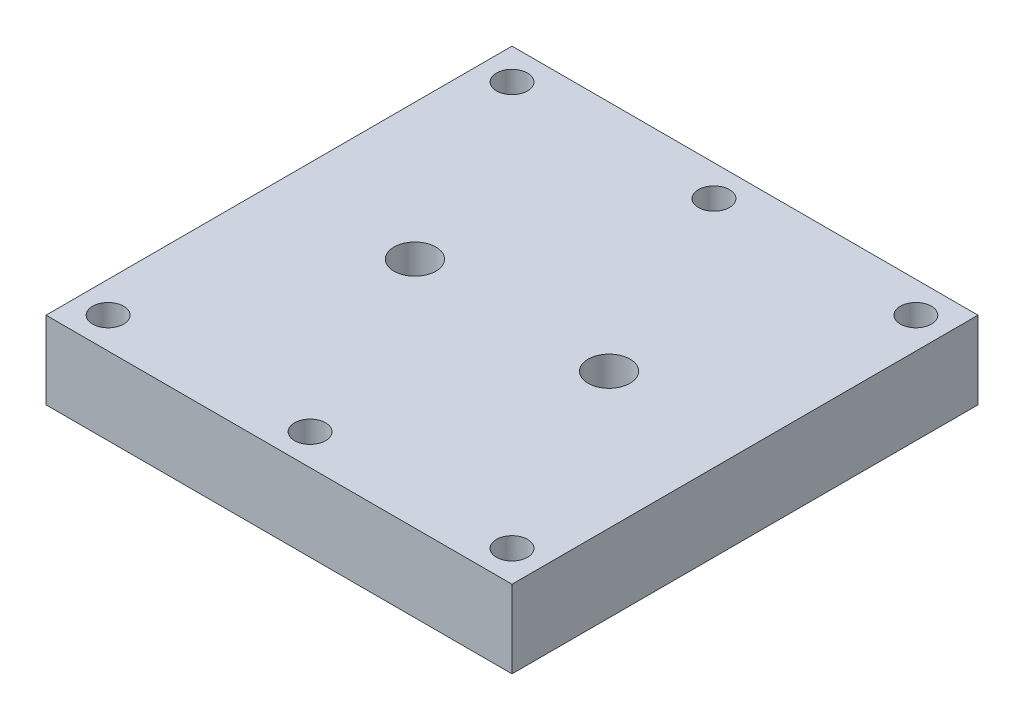
ISO-10303-21;
HEADER;
FILE_DESCRIPTION(('STEP AP214'),'2;1');
FILE_NAME('part.step','',(''),(''),'','','');
FILE_SCHEMA(('AUTOMOTIVE_DESIGN { 1 0 10303 214 1 1 1 1 }'));
ENDSEC;
DATA;
#1=APPLICATION_CONTEXT('core data for automotive mechanical design processes');
#2=APPLICATION_PROTOCOL_DEFINITION('international standard','automotive_design',2000,#1);
#3=PRODUCT_CONTEXT('',#1,'mechanical');
#4=PRODUCT('Part','Part','',(#3));
#5=PRODUCT_RELATED_PRODUCT_CATEGORY('part','',(#4));
#6=PRODUCT_DEFINITION_FORMATION('','',#4);
#7=PRODUCT_DEFINITION_CONTEXT('part definition',#1,'design');
#8=PRODUCT_DEFINITION('design','',#6,#7);
#9=PRODUCT_DEFINITION_SHAPE('','',#8);
#10=(LENGTH_UNIT() NAMED_UNIT(*) SI_UNIT(.MILLI.,.METRE.));
#11=(NAMED_UNIT(*) PLANE_ANGLE_UNIT() SI_UNIT($,.RADIAN.));
#12=(NAMED_UNIT(*) SI_UNIT($,.STERADIAN.) SOLID_ANGLE_UNIT());
#13=UNCERTAINTY_MEASURE_WITH_UNIT(LENGTH_MEASURE(1.E-05),#10,'distance_accuracy_value','');
#14=(GEOMETRIC_REPRESENTATION_CONTEXT(3) GLOBAL_UNCERTAINTY_ASSIGNED_CONTEXT((#13)) GLOBAL_UNIT_ASSIGNED_CONTEXT((#10,
#11,#12)) REPRESENTATION_CONTEXT('',''));
#15=CARTESIAN_POINT('',(0.,0.,0.));
#16=DIRECTION('',(0.,0.,1.));
#17=DIRECTION('',(1.,0.,0.));
#18=AXIS2_PLACEMENT_3D('',#15,#16,#17);
#19=CARTESIAN_POINT('',(-30.,10.,30.));
#20=DIRECTION('',(1.,0.,0.));
#21=DIRECTION('',(0.,0.,-1.));
#22=AXIS2_PLACEMENT_3D('',#19,#20,#21);
#23=PLANE('',#22);
#24=DIRECTION('',(0.,0.,1.));
#25=VECTOR('',#24,1.);
#26=CARTESIAN_POINT('',(-30.,0.,30.));
#27=LINE('',#26,#25);
#28=CARTESIAN_POINT('',(-30.,0.,-30.));
#29=VERTEX_POINT('',#28);
#30=CARTESIAN_POINT('',(-30.,0.,30.));
#31=VERTEX_POINT('',#30);
#32=EDGE_CURVE('E100',#29,#31,#27,.T.);
#33=ORIENTED_EDGE('',*,*,#32,.T.);
#34=DIRECTION('',(0.,-1.,0.));
#35=VECTOR('',#34,1.);
#36=CARTESIAN_POINT('',(-30.,10.,30.));
#37=LINE('',#36,#35);
#38=CARTESIAN_POINT('',(-30.,10.,30.));
#39=VERTEX_POINT('',#38);
#40=EDGE_CURVE('E11',#39,#31,#37,.T.);
#41=ORIENTED_EDGE('',*,*,#40,.F.);
#42=DIRECTION('',(0.,0.,1.));
#43=VECTOR('',#42,1.);
#44=CARTESIAN_POINT('',(-30.,10.,30.));
#45=LINE('',#44,#43);
#46=CARTESIAN_POINT('',(-30.,10.,-30.));
#47=VERTEX_POINT('',#46);
#48=EDGE_CURVE('E88',#47,#39,#45,.T.);
#49=ORIENTED_EDGE('',*,*,#48,.F.);
#50=DIRECTION('',(0.,-1.,0.));
#51=VECTOR('',#50,1.);
#52=CARTESIAN_POINT('',(-30.,10.,-30.));
#53=LINE('',#52,#51);
#54=EDGE_CURVE('E96',#47,#29,#53,.T.);
#55=ORIENTED_EDGE('',*,*,#54,.T.);
#56=EDGE_LOOP('',(#33,#41,#49,#55));
#57=FACE_BOUND('',#56,.T.);
#58=ADVANCED_FACE('F37',(#57),#23,.F.);
#59=CARTESIAN_POINT('',(30.,10.,30.));
#60=DIRECTION('',(0.,0.,-1.));
#61=DIRECTION('',(-1.,0.,0.));
#62=AXIS2_PLACEMENT_3D('',#59,#60,#61);
#63=PLANE('',#62);
#64=DIRECTION('',(1.,0.,0.));
#65=VECTOR('',#64,1.);
#66=CARTESIAN_POINT('',(30.,0.,30.));
#67=LINE('',#66,#65);
#68=CARTESIAN_POINT('',(30.,0.,30.));
#69=VERTEX_POINT('',#68);
#70=EDGE_CURVE('E92',#31,#69,#67,.T.);
#71=ORIENTED_EDGE('',*,*,#70,.T.);
#72=DIRECTION('',(0.,-1.,0.));
#73=VECTOR('',#72,1.);
#74=CARTESIAN_POINT('',(30.,10.,30.));
#75=LINE('',#74,#73);
#76=CARTESIAN_POINT('',(30.,10.,30.));
#77=VERTEX_POINT('',#76);
#78=EDGE_CURVE('E45',#77,#69,#75,.T.);
#79=ORIENTED_EDGE('',*,*,#78,.F.);
#80=DIRECTION('',(1.,0.,0.));
#81=VECTOR('',#80,1.);
#82=CARTESIAN_POINT('',(30.,10.,30.));
#83=LINE('',#82,#81);
#84=EDGE_CURVE('E83',#39,#77,#83,.T.);
#85=ORIENTED_EDGE('',*,*,#84,.F.);
#86=ORIENTED_EDGE('',*,*,#40,.T.);
#87=EDGE_LOOP('',(#71,#79,#85,#86));
#88=FACE_BOUND('',#87,.T.);
#89=ADVANCED_FACE('F91',(#88),#63,.F.);
#90=CARTESIAN_POINT('',(30.,10.,30.));
#91=DIRECTION('',(-1.,0.,0.));
#92=DIRECTION('',(0.,0.,1.));
#93=AXIS2_PLACEMENT_3D('',#90,#91,#92);
#94=PLANE('',#93);
#95=DIRECTION('',(0.,0.,-1.));
#96=VECTOR('',#95,1.);
#97=CARTESIAN_POINT('',(30.,0.,30.));
#98=LINE('',#97,#96);
#99=CARTESIAN_POINT('',(30.,0.,-30.));
#100=VERTEX_POINT('',#99);
#101=EDGE_CURVE('E70',#69,#100,#98,.T.);
#102=ORIENTED_EDGE('',*,*,#101,.T.);
#103=DIRECTION('',(0.,-1.,0.));
#104=VECTOR('',#103,1.);
#105=CARTESIAN_POINT('',(30.,10.,-30.));
#106=LINE('',#105,#104);
#107=CARTESIAN_POINT('',(30.,10.,-30.));
#108=VERTEX_POINT('',#107);
#109=EDGE_CURVE('E93',#108,#100,#106,.T.);
#110=ORIENTED_EDGE('',*,*,#109,.F.);
#111=DIRECTION('',(0.,0.,-1.));
#112=VECTOR('',#111,1.);
#113=CARTESIAN_POINT('',(30.,10.,30.));
#114=LINE('',#113,#112);
#115=EDGE_CURVE('E86',#77,#108,#114,.T.);
#116=ORIENTED_EDGE('',*,*,#115,.F.);
#117=ORIENTED_EDGE('',*,*,#78,.T.);
#118=EDGE_LOOP('',(#102,#110,#116,#117));
#119=FACE_BOUND('',#118,.T.);
#120=ADVANCED_FACE('F94',(#119),#94,.F.);
#121=CARTESIAN_POINT('',(30.,10.,-30.));
#122=DIRECTION('',(0.,0.,1.));
#123=DIRECTION('',(1.,0.,0.));
#124=AXIS2_PLACEMENT_3D('',#121,#122,#123);
#125=PLANE('',#124);
#126=DIRECTION('',(-1.,0.,0.));
#127=VECTOR('',#126,1.);
#128=CARTESIAN_POINT('',(30.,0.,-30.));
#129=LINE('',#128,#127);
#130=EDGE_CURVE('E76',#100,#29,#129,.T.);
#131=ORIENTED_EDGE('',*,*,#130,.T.);
#132=ORIENTED_EDGE('',*,*,#54,.F.);
#133=DIRECTION('',(-1.,0.,0.));
#134=VECTOR('',#133,1.);
#135=CARTESIAN_POINT('',(30.,10.,-30.));
#136=LINE('',#135,#134);
#137=EDGE_CURVE('E53',#108,#47,#136,.T.);
#138=ORIENTED_EDGE('',*,*,#137,.F.);
#139=ORIENTED_EDGE('',*,*,#109,.T.);
#140=EDGE_LOOP('',(#131,#132,#138,#139));
#141=FACE_BOUND('',#140,.T.);
#142=ADVANCED_FACE('F108',(#141),#125,.F.);
#143=CARTESIAN_POINT('',(0.,10.,0.));
#144=DIRECTION('',(0.,1.,0.));
#145=DIRECTION('',(0.,0.,1.));
#146=AXIS2_PLACEMENT_3D('',#143,#144,#145);
#147=PLANE('',#146);
#148=CARTESIAN_POINT('',(-12.5,10.,0.));
#149=DIRECTION('',(0.,1.,0.));
#150=DIRECTION('',(0.,0.,1.));
#151=AXIS2_PLACEMENT_3D('',#148,#149,#150);
#152=CIRCLE('',#151,2.7);
#153=CARTESIAN_POINT('',(-12.5,10.,2.7));
#154=VERTEX_POINT('',#153);
#155=EDGE_CURVE('E162',#154,#154,#152,.T.);
#156=ORIENTED_EDGE('',*,*,#155,.F.);
#157=EDGE_LOOP('',(#156));
#158=FACE_BOUND('',#157,.T.);
#159=CARTESIAN_POINT('',(12.5,10.,0.));
#160=DIRECTION('',(0.,1.,0.));
#161=DIRECTION('',(0.,0.,1.));
#162=AXIS2_PLACEMENT_3D('',#159,#160,#161);
#163=CIRCLE('',#162,2.7);
#164=CARTESIAN_POINT('',(12.5,10.,2.7));
#165=VERTEX_POINT('',#164);
#166=EDGE_CURVE('E156',#165,#165,#163,.T.);
#167=ORIENTED_EDGE('',*,*,#166,.F.);
#168=EDGE_LOOP('',(#167));
#169=FACE_BOUND('',#168,.T.);
#170=CARTESIAN_POINT('',(0.,10.,-26.));
#171=DIRECTION('',(0.,1.,0.));
#172=DIRECTION('',(0.,0.,1.));
#173=AXIS2_PLACEMENT_3D('',#170,#171,#172);
#174=CIRCLE('',#173,2.);
#175=CARTESIAN_POINT('',(0.,10.,-24.));
#176=VERTEX_POINT('',#175);
#177=EDGE_CURVE('E144',#176,#176,#174,.T.);
#178=ORIENTED_EDGE('',*,*,#177,.F.);
#179=EDGE_LOOP('',(#178));
#180=FACE_BOUND('',#179,.T.);
#181=CARTESIAN_POINT('',(26.,10.,-26.));
#182=DIRECTION('',(0.,1.,0.));
#183=DIRECTION('',(0.,0.,1.));
#184=AXIS2_PLACEMENT_3D('',#181,#182,#183);
#185=CIRCLE('',#184,2.);
#186=CARTESIAN_POINT('',(26.,10.,-24.));
#187=VERTEX_POINT('',#186);
#188=EDGE_CURVE('E138',#187,#187,#185,.T.);
#189=ORIENTED_EDGE('',*,*,#188,.F.);
#190=EDGE_LOOP('',(#189));
#191=FACE_BOUND('',#190,.T.);
#192=CARTESIAN_POINT('',(26.,10.,26.));
#193=DIRECTION('',(0.,1.,0.));
#194=DIRECTION('',(0.,0.,1.));
#195=AXIS2_PLACEMENT_3D('',#192,#193,#194);
#196=CIRCLE('',#195,2.);
#197=CARTESIAN_POINT('',(26.,10.,28.));
#198=VERTEX_POINT('',#197);
#199=EDGE_CURVE('E132',#198,#198,#196,.T.);
#200=ORIENTED_EDGE('',*,*,#199,.F.);
#201=EDGE_LOOP('',(#200));
#202=FACE_BOUND('',#201,.T.);
#203=CARTESIAN_POINT('',(0.,10.,26.));
#204=DIRECTION('',(0.,1.,0.));
#205=DIRECTION('',(0.,0.,1.));
#206=AXIS2_PLACEMENT_3D('',#203,#204,#205);
#207=CIRCLE('',#206,2.);
#208=CARTESIAN_POINT('',(0.,10.,28.));
#209=VERTEX_POINT('',#208);
#210=EDGE_CURVE('E126',#209,#209,#207,.T.);
#211=ORIENTED_EDGE('',*,*,#210,.F.);
#212=EDGE_LOOP('',(#211));
#213=FACE_BOUND('',#212,.T.);
#214=CARTESIAN_POINT('',(-26.,10.,26.));
#215=DIRECTION('',(0.,1.,0.));
#216=DIRECTION('',(0.,0.,1.));
#217=AXIS2_PLACEMENT_3D('',#214,#215,#216);
#218=CIRCLE('',#217,2.);
#219=CARTESIAN_POINT('',(-26.,10.,28.));
#220=VERTEX_POINT('',#219);
#221=EDGE_CURVE('E120',#220,#220,#218,.T.);
#222=ORIENTED_EDGE('',*,*,#221,.F.);
#223=EDGE_LOOP('',(#222));
#224=FACE_BOUND('',#223,.T.);
#225=CARTESIAN_POINT('',(-26.,10.,-26.));
#226=DIRECTION('',(0.,1.,0.));
#227=DIRECTION('',(0.,0.,1.));
#228=AXIS2_PLACEMENT_3D('',#225,#226,#227);
#229=CIRCLE('',#228,2.);
#230=CARTESIAN_POINT('',(-26.,10.,-24.));
#231=VERTEX_POINT('',#230);
#232=EDGE_CURVE('E114',#231,#231,#229,.T.);
#233=ORIENTED_EDGE('',*,*,#232,.F.);
#234=EDGE_LOOP('',(#233));
#235=FACE_BOUND('',#234,.T.);
#236=ORIENTED_EDGE('',*,*,#48,.T.);
#237=ORIENTED_EDGE('',*,*,#84,.T.);
#238=ORIENTED_EDGE('',*,*,#115,.T.);
#239=ORIENTED_EDGE('',*,*,#137,.T.);
#240=EDGE_LOOP('',(#236,#237,#238,#239));
#241=FACE_BOUND('',#240,.T.);
#242=ADVANCED_FACE('F84',(#158,#169,#180,#191,#202,#213,#224,#235,#241),#147,.T.);
#243=CARTESIAN_POINT('',(0.,0.,0.));
#244=DIRECTION('',(0.,1.,0.));
#245=DIRECTION('',(0.,0.,1.));
#246=AXIS2_PLACEMENT_3D('',#243,#244,#245);
#247=PLANE('',#246);
#248=CARTESIAN_POINT('',(-12.5,0.,0.));
#249=DIRECTION('',(0.,-1.,0.));
#250=DIRECTION('',(0.,0.,-1.));
#251=AXIS2_PLACEMENT_3D('',#248,#249,#250);
#252=CIRCLE('',#251,0.500000000000001);
#253=CARTESIAN_POINT('',(-12.5,0.,-0.500000000000001));
#254=VERTEX_POINT('',#253);
#255=EDGE_CURVE('E174',#254,#254,#252,.T.);
#256=ORIENTED_EDGE('',*,*,#255,.F.);
#257=EDGE_LOOP('',(#256));
#258=FACE_BOUND('',#257,.T.);
#259=CARTESIAN_POINT('',(12.5,0.,0.));
#260=DIRECTION('',(0.,-1.,0.));
#261=DIRECTION('',(0.,0.,-1.));
#262=AXIS2_PLACEMENT_3D('',#259,#260,#261);
#263=CIRCLE('',#262,0.500000000000001);
#264=CARTESIAN_POINT('',(12.5,0.,-0.500000000000001));
#265=VERTEX_POINT('',#264);
#266=EDGE_CURVE('E168',#265,#265,#263,.T.);
#267=ORIENTED_EDGE('',*,*,#266,.F.);
#268=EDGE_LOOP('',(#267));
#269=FACE_BOUND('',#268,.T.);
#270=CARTESIAN_POINT('',(0.,0.,0.));
#271=DIRECTION('',(0.,-1.,0.));
#272=DIRECTION('',(0.,0.,-1.));
#273=AXIS2_PLACEMENT_3D('',#270,#271,#272);
#274=CIRCLE('',#273,6.35);
#275=CARTESIAN_POINT('',(0.,0.,-6.35));
#276=VERTEX_POINT('',#275);
#277=EDGE_CURVE('E150',#276,#276,#274,.T.);
#278=ORIENTED_EDGE('',*,*,#277,.F.);
#279=EDGE_LOOP('',(#278));
#280=FACE_BOUND('',#279,.T.);
#281=CARTESIAN_POINT('',(0.,0.,-26.));
#282=DIRECTION('',(0.,1.,0.));
#283=DIRECTION('',(0.,0.,1.));
#284=AXIS2_PLACEMENT_3D('',#281,#282,#283);
#285=CIRCLE('',#284,2.);
#286=CARTESIAN_POINT('',(0.,0.,-24.));
#287=VERTEX_POINT('',#286);
#288=EDGE_CURVE('E141',#287,#287,#285,.T.);
#289=ORIENTED_EDGE('',*,*,#288,.T.);
#290=EDGE_LOOP('',(#289));
#291=FACE_BOUND('',#290,.T.);
#292=CARTESIAN_POINT('',(26.,0.,-26.));
#293=DIRECTION('',(0.,1.,0.));
#294=DIRECTION('',(0.,0.,1.));
#295=AXIS2_PLACEMENT_3D('',#292,#293,#294);
#296=CIRCLE('',#295,2.);
#297=CARTESIAN_POINT('',(26.,0.,-24.));
#298=VERTEX_POINT('',#297);
#299=EDGE_CURVE('E135',#298,#298,#296,.T.);
#300=ORIENTED_EDGE('',*,*,#299,.T.);
#301=EDGE_LOOP('',(#300));
#302=FACE_BOUND('',#301,.T.);
#303=CARTESIAN_POINT('',(26.,0.,26.));
#304=DIRECTION('',(0.,1.,0.));
#305=DIRECTION('',(0.,0.,1.));
#306=AXIS2_PLACEMENT_3D('',#303,#304,#305);
#307=CIRCLE('',#306,2.);
#308=CARTESIAN_POINT('',(26.,0.,28.));
#309=VERTEX_POINT('',#308);
#310=EDGE_CURVE('E129',#309,#309,#307,.T.);
#311=ORIENTED_EDGE('',*,*,#310,.T.);
#312=EDGE_LOOP('',(#311));
#313=FACE_BOUND('',#312,.T.);
#314=CARTESIAN_POINT('',(0.,0.,26.));
#315=DIRECTION('',(0.,1.,0.));
#316=DIRECTION('',(0.,0.,1.));
#317=AXIS2_PLACEMENT_3D('',#314,#315,#316);
#318=CIRCLE('',#317,2.);
#319=CARTESIAN_POINT('',(0.,0.,28.));
#320=VERTEX_POINT('',#319);
#321=EDGE_CURVE('E123',#320,#320,#318,.T.);
#322=ORIENTED_EDGE('',*,*,#321,.T.);
#323=EDGE_LOOP('',(#322));
#324=FACE_BOUND('',#323,.T.);
#325=CARTESIAN_POINT('',(-26.,0.,26.));
#326=DIRECTION('',(0.,1.,0.));
#327=DIRECTION('',(0.,0.,1.));
#328=AXIS2_PLACEMENT_3D('',#325,#326,#327);
#329=CIRCLE('',#328,2.);
#330=CARTESIAN_POINT('',(-26.,0.,28.));
#331=VERTEX_POINT('',#330);
#332=EDGE_CURVE('E117',#331,#331,#329,.T.);
#333=ORIENTED_EDGE('',*,*,#332,.T.);
#334=EDGE_LOOP('',(#333));
#335=FACE_BOUND('',#334,.T.);
#336=CARTESIAN_POINT('',(-26.,0.,-26.));
#337=DIRECTION('',(0.,1.,0.));
#338=DIRECTION('',(0.,0.,1.));
#339=AXIS2_PLACEMENT_3D('',#336,#337,#338);
#340=CIRCLE('',#339,2.);
#341=CARTESIAN_POINT('',(-26.,0.,-24.));
#342=VERTEX_POINT('',#341);
#343=EDGE_CURVE('E103',#342,#342,#340,.T.);
#344=ORIENTED_EDGE('',*,*,#343,.T.);
#345=EDGE_LOOP('',(#344));
#346=FACE_BOUND('',#345,.T.);
#347=ORIENTED_EDGE('',*,*,#32,.F.);
#348=ORIENTED_EDGE('',*,*,#130,.F.);
#349=ORIENTED_EDGE('',*,*,#101,.F.);
#350=ORIENTED_EDGE('',*,*,#70,.F.);
#351=EDGE_LOOP('',(#347,#348,#349,#350));
#352=FACE_BOUND('',#351,.T.);
#353=ADVANCED_FACE('F111',(#258,#269,#280,#291,#302,#313,#324,#335,#346,#352),#247,.F.);
#354=CARTESIAN_POINT('',(-26.,0.,-26.));
#355=DIRECTION('',(0.,1.,0.));
#356=DIRECTION('',(0.,0.,1.));
#357=AXIS2_PLACEMENT_3D('',#354,#355,#356);
#358=CYLINDRICAL_SURFACE('',#357,2.);
#359=ORIENTED_EDGE('',*,*,#343,.F.);
#360=EDGE_LOOP('',(#359));
#361=FACE_BOUND('',#360,.T.);
#362=ORIENTED_EDGE('',*,*,#232,.T.);
#363=EDGE_LOOP('',(#362));
#364=FACE_BOUND('',#363,.T.);
#365=ADVANCED_FACE('F192',(#361,#364),#358,.F.);
#366=CARTESIAN_POINT('',(-26.,0.,26.));
#367=DIRECTION('',(0.,1.,0.));
#368=DIRECTION('',(0.,0.,1.));
#369=AXIS2_PLACEMENT_3D('',#366,#367,#368);
#370=CYLINDRICAL_SURFACE('',#369,2.);
#371=ORIENTED_EDGE('',*,*,#332,.F.);
#372=EDGE_LOOP('',(#371));
#373=FACE_BOUND('',#372,.T.);
#374=ORIENTED_EDGE('',*,*,#221,.T.);
#375=EDGE_LOOP('',(#374));
#376=FACE_BOUND('',#375,.T.);
#377=ADVANCED_FACE('F212',(#373,#376),#370,.F.);
#378=CARTESIAN_POINT('',(0.,0.,26.));
#379=DIRECTION('',(0.,1.,0.));
#380=DIRECTION('',(0.,0.,1.));
#381=AXIS2_PLACEMENT_3D('',#378,#379,#380);
#382=CYLINDRICAL_SURFACE('',#381,2.);
#383=ORIENTED_EDGE('',*,*,#321,.F.);
#384=EDGE_LOOP('',(#383));
#385=FACE_BOUND('',#384,.T.);
#386=ORIENTED_EDGE('',*,*,#210,.T.);
#387=EDGE_LOOP('',(#386));
#388=FACE_BOUND('',#387,.T.);
#389=ADVANCED_FACE('F256',(#385,#388),#382,.F.);
#390=CARTESIAN_POINT('',(26.,0.,26.));
#391=DIRECTION('',(0.,1.,0.));
#392=DIRECTION('',(0.,0.,1.));
#393=AXIS2_PLACEMENT_3D('',#390,#391,#392);
#394=CYLINDRICAL_SURFACE('',#393,2.);
#395=ORIENTED_EDGE('',*,*,#310,.F.);
#396=EDGE_LOOP('',(#395));
#397=FACE_BOUND('',#396,.T.);
#398=ORIENTED_EDGE('',*,*,#199,.T.);
#399=EDGE_LOOP('',(#398));
#400=FACE_BOUND('',#399,.T.);
#401=ADVANCED_FACE('F266',(#397,#400),#394,.F.);
#402=CARTESIAN_POINT('',(26.,0.,-26.));
#403=DIRECTION('',(0.,1.,0.));
#404=DIRECTION('',(0.,0.,1.));
#405=AXIS2_PLACEMENT_3D('',#402,#403,#404);
#406=CYLINDRICAL_SURFACE('',#405,2.);
#407=ORIENTED_EDGE('',*,*,#299,.F.);
#408=EDGE_LOOP('',(#407));
#409=FACE_BOUND('',#408,.T.);
#410=ORIENTED_EDGE('',*,*,#188,.T.);
#411=EDGE_LOOP('',(#410));
#412=FACE_BOUND('',#411,.T.);
#413=ADVANCED_FACE('F276',(#409,#412),#406,.F.);
#414=CARTESIAN_POINT('',(0.,0.,-26.));
#415=DIRECTION('',(0.,1.,0.));
#416=DIRECTION('',(0.,0.,1.));
#417=AXIS2_PLACEMENT_3D('',#414,#415,#416);
#418=CYLINDRICAL_SURFACE('',#417,2.);
#419=ORIENTED_EDGE('',*,*,#288,.F.);
#420=EDGE_LOOP('',(#419));
#421=FACE_BOUND('',#420,.T.);
#422=ORIENTED_EDGE('',*,*,#177,.T.);
#423=EDGE_LOOP('',(#422));
#424=FACE_BOUND('',#423,.T.);
#425=ADVANCED_FACE('F286',(#421,#424),#418,.F.);
#426=CARTESIAN_POINT('',(0.,3.2,0.));
#427=DIRECTION('',(0.,-1.,0.));
#428=DIRECTION('',(0.,0.,-1.));
#429=AXIS2_PLACEMENT_3D('',#426,#427,#428);
#430=CYLINDRICAL_SURFACE('',#429,6.35);
#431=CARTESIAN_POINT('',(0.,3.2,0.));
#432=DIRECTION('',(0.,-1.,0.));
#433=DIRECTION('',(0.,0.,-1.));
#434=AXIS2_PLACEMENT_3D('',#431,#432,#433);
#435=CIRCLE('',#434,6.35);
#436=CARTESIAN_POINT('',(0.,3.2,-6.35));
#437=VERTEX_POINT('',#436);
#438=EDGE_CURVE('E147',#437,#437,#435,.T.);
#439=ORIENTED_EDGE('',*,*,#438,.F.);
#440=EDGE_LOOP('',(#439));
#441=FACE_BOUND('',#440,.T.);
#442=ORIENTED_EDGE('',*,*,#277,.T.);
#443=EDGE_LOOP('',(#442));
#444=FACE_BOUND('',#443,.T.);
#445=ADVANCED_FACE('F296',(#441,#444),#430,.F.);
#446=CARTESIAN_POINT('',(0.,3.2,0.));
#447=DIRECTION('',(0.,-1.,0.));
#448=DIRECTION('',(0.,0.,-1.));
#449=AXIS2_PLACEMENT_3D('',#446,#447,#448);
#450=PLANE('',#449);
#451=ORIENTED_EDGE('',*,*,#438,.T.);
#452=EDGE_LOOP('',(#451));
#453=FACE_BOUND('',#452,.T.);
#454=ADVANCED_FACE('F306',(#453),#450,.T.);
#455=CARTESIAN_POINT('',(12.5,3.,0.));
#456=DIRECTION('',(0.,1.,0.));
#457=DIRECTION('',(0.,0.,1.));
#458=AXIS2_PLACEMENT_3D('',#455,#456,#457);
#459=CYLINDRICAL_SURFACE('',#458,2.7);
#460=CARTESIAN_POINT('',(12.5,3.,0.));
#461=DIRECTION('',(0.,1.,0.));
#462=DIRECTION('',(0.,0.,1.));
#463=AXIS2_PLACEMENT_3D('',#460,#461,#462);
#464=CIRCLE('',#463,2.7);
#465=CARTESIAN_POINT('',(12.5,3.,2.7));
#466=VERTEX_POINT('',#465);
#467=EDGE_CURVE('E153',#466,#466,#464,.T.);
#468=ORIENTED_EDGE('',*,*,#467,.F.);
#469=EDGE_LOOP('',(#468));
#470=FACE_BOUND('',#469,.T.);
#471=ORIENTED_EDGE('',*,*,#166,.T.);
#472=EDGE_LOOP('',(#471));
#473=FACE_BOUND('',#472,.T.);
#474=ADVANCED_FACE('F316',(#470,#473),#459,.F.);
#475=CARTESIAN_POINT('',(12.5,3.,0.));
#476=DIRECTION('',(0.,1.,0.));
#477=DIRECTION('',(0.,0.,1.));
#478=AXIS2_PLACEMENT_3D('',#475,#476,#477);
#479=PLANE('',#478);
#480=CARTESIAN_POINT('',(12.5,3.,0.));
#481=DIRECTION('',(0.,-1.,0.));
#482=DIRECTION('',(0.,0.,-1.));
#483=AXIS2_PLACEMENT_3D('',#480,#481,#482);
#484=CIRCLE('',#483,0.500000000000001);
#485=CARTESIAN_POINT('',(12.5,3.,-0.500000000000001));
#486=VERTEX_POINT('',#485);
#487=EDGE_CURVE('E165',#486,#486,#484,.T.);
#488=ORIENTED_EDGE('',*,*,#487,.T.);
#489=EDGE_LOOP('',(#488));
#490=FACE_BOUND('',#489,.T.);
#491=ORIENTED_EDGE('',*,*,#467,.T.);
#492=EDGE_LOOP('',(#491));
#493=FACE_BOUND('',#492,.T.);
#494=ADVANCED_FACE('F333',(#490,#493),#479,.T.);
#495=CARTESIAN_POINT('',(-12.5,3.,0.));
#496=DIRECTION('',(0.,1.,0.));
#497=DIRECTION('',(0.,0.,1.));
#498=AXIS2_PLACEMENT_3D('',#495,#496,#497);
#499=CYLINDRICAL_SURFACE('',#498,2.7);
#500=CARTESIAN_POINT('',(-12.5,3.,0.));
#501=DIRECTION('',(0.,1.,0.));
#502=DIRECTION('',(0.,0.,1.));
#503=AXIS2_PLACEMENT_3D('',#500,#501,#502);
#504=CIRCLE('',#503,2.7);
#505=CARTESIAN_POINT('',(-12.5,3.,2.7));
#506=VERTEX_POINT('',#505);
#507=EDGE_CURVE('E159',#506,#506,#504,.T.);
#508=ORIENTED_EDGE('',*,*,#507,.F.);
#509=EDGE_LOOP('',(#508));
#510=FACE_BOUND('',#509,.T.);
#511=ORIENTED_EDGE('',*,*,#155,.T.);
#512=EDGE_LOOP('',(#511));
#513=FACE_BOUND('',#512,.T.);
#514=ADVANCED_FACE('F341',(#510,#513),#499,.F.);
#515=CARTESIAN_POINT('',(-12.5,3.,0.));
#516=DIRECTION('',(0.,1.,0.));
#517=DIRECTION('',(0.,0.,1.));
#518=AXIS2_PLACEMENT_3D('',#515,#516,#517);
#519=PLANE('',#518);
#520=CARTESIAN_POINT('',(-12.5,3.,0.));
#521=DIRECTION('',(0.,-1.,0.));
#522=DIRECTION('',(0.,0.,-1.));
#523=AXIS2_PLACEMENT_3D('',#520,#521,#522);
#524=CIRCLE('',#523,0.500000000000001);
#525=CARTESIAN_POINT('',(-12.5,3.,-0.500000000000001));
#526=VERTEX_POINT('',#525);
#527=EDGE_CURVE('E171',#526,#526,#524,.T.);
#528=ORIENTED_EDGE('',*,*,#527,.T.);
#529=EDGE_LOOP('',(#528));
#530=FACE_BOUND('',#529,.T.);
#531=ORIENTED_EDGE('',*,*,#507,.T.);
#532=EDGE_LOOP('',(#531));
#533=FACE_BOUND('',#532,.T.);
#534=ADVANCED_FACE('F180',(#530,#533),#519,.T.);
#535=CARTESIAN_POINT('',(12.5,3.,0.));
#536=DIRECTION('',(0.,-1.,0.));
#537=DIRECTION('',(0.,0.,-1.));
#538=AXIS2_PLACEMENT_3D('',#535,#536,#537);
#539=CYLINDRICAL_SURFACE('',#538,0.500000000000001);
#540=ORIENTED_EDGE('',*,*,#487,.F.);
#541=EDGE_LOOP('',(#540));
#542=FACE_BOUND('',#541,.T.);
#543=ORIENTED_EDGE('',*,*,#266,.T.);
#544=EDGE_LOOP('',(#543));
#545=FACE_BOUND('',#544,.T.);
#546=ADVANCED_FACE('F186',(#542,#545),#539,.F.);
#547=CARTESIAN_POINT('',(-12.5,3.,0.));
#548=DIRECTION('',(0.,-1.,0.));
#549=DIRECTION('',(0.,0.,-1.));
#550=AXIS2_PLACEMENT_3D('',#547,#548,#549);
#551=CYLINDRICAL_SURFACE('',#550,0.500000000000001);
#552=ORIENTED_EDGE('',*,*,#527,.F.);
#553=EDGE_LOOP('',(#552));
#554=FACE_BOUND('',#553,.T.);
#555=ORIENTED_EDGE('',*,*,#255,.T.);
#556=EDGE_LOOP('',(#555));
#557=FACE_BOUND('',#556,.T.);
#558=ADVANCED_FACE('F183',(#554,#557),#551,.F.);
#559=CLOSED_SHELL('',(#58,#89,#120,#142,#242,#353,#365,#377,#389,#401,#413,#425,#445,#454,#474,
#494,#514,#534,#546,#558));
#560=MANIFOLD_SOLID_BREP('B2',#559);
#561=ADVANCED_BREP_SHAPE_REPRESENTATION('',(#18,#560),#14);
#562=SHAPE_DEFINITION_REPRESENTATION(#9,#561);
ENDSEC;
END-ISO-10303-21;
